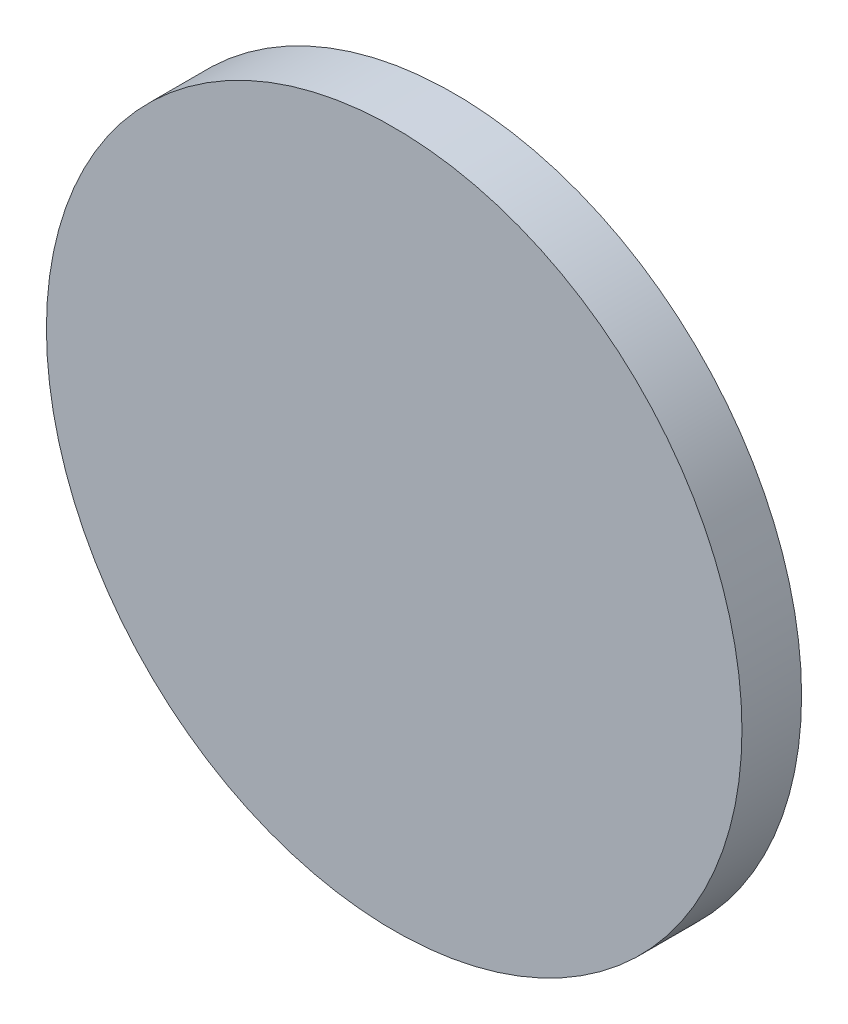
ISO-10303-21;
HEADER;
FILE_DESCRIPTION(('STEP AP214'),'2;1');
FILE_NAME('part.step','',(''),(''),'','','');
FILE_SCHEMA(('AUTOMOTIVE_DESIGN { 1 0 10303 214 1 1 1 1 }'));
ENDSEC;
DATA;
#1=APPLICATION_CONTEXT('core data for automotive mechanical design processes');
#2=APPLICATION_PROTOCOL_DEFINITION('international standard','automotive_design',2000,#1);
#3=PRODUCT_CONTEXT('',#1,'mechanical');
#4=PRODUCT('Part','Part','',(#3));
#5=PRODUCT_RELATED_PRODUCT_CATEGORY('part','',(#4));
#6=PRODUCT_DEFINITION_FORMATION('','',#4);
#7=PRODUCT_DEFINITION_CONTEXT('part definition',#1,'design');
#8=PRODUCT_DEFINITION('design','',#6,#7);
#9=PRODUCT_DEFINITION_SHAPE('','',#8);
#10=(LENGTH_UNIT() NAMED_UNIT(*) SI_UNIT(.MILLI.,.METRE.));
#11=(NAMED_UNIT(*) PLANE_ANGLE_UNIT() SI_UNIT($,.RADIAN.));
#12=(NAMED_UNIT(*) SI_UNIT($,.STERADIAN.) SOLID_ANGLE_UNIT());
#13=UNCERTAINTY_MEASURE_WITH_UNIT(LENGTH_MEASURE(1.E-05),#10,'distance_accuracy_value','');
#14=(GEOMETRIC_REPRESENTATION_CONTEXT(3) GLOBAL_UNCERTAINTY_ASSIGNED_CONTEXT((#13)) GLOBAL_UNIT_ASSIGNED_CONTEXT((#10,
#11,#12)) REPRESENTATION_CONTEXT('',''));
#15=CARTESIAN_POINT('',(0.,0.,0.));
#16=DIRECTION('',(0.,0.,1.));
#17=DIRECTION('',(1.,0.,0.));
#18=AXIS2_PLACEMENT_3D('',#15,#16,#17);
#19=CARTESIAN_POINT('',(5.6007,3.7719,0.79916));
#20=DIRECTION('',(0.,0.,1.));
#21=DIRECTION('',(1.,0.,0.));
#22=AXIS2_PLACEMENT_3D('',#19,#20,#21);
#23=PLANE('',#22);
#24=CARTESIAN_POINT('',(5.6007,3.7719,0.79916));
#25=DIRECTION('',(0.,0.,1.));
#26=DIRECTION('',(1.,0.,0.));
#27=AXIS2_PLACEMENT_3D('',#24,#25,#26);
#28=CIRCLE('',#27,0.200024667);
#29=CARTESIAN_POINT('',(5.800724667,3.7719,0.79916));
#30=VERTEX_POINT('',#29);
#31=EDGE_CURVE('E18',#30,#30,#28,.F.);
#32=ORIENTED_EDGE('',*,*,#31,.F.);
#33=EDGE_LOOP('',(#32));
#34=FACE_BOUND('',#33,.T.);
#35=ADVANCED_FACE('F15',(#34),#23,.T.);
#36=CARTESIAN_POINT('',(5.6007,3.7719,0.76487));
#37=DIRECTION('',(0.,0.,1.));
#38=DIRECTION('',(1.,0.,0.));
#39=AXIS2_PLACEMENT_3D('',#36,#37,#38);
#40=CYLINDRICAL_SURFACE('',#39,0.200024667);
#41=ORIENTED_EDGE('',*,*,#31,.T.);
#42=EDGE_LOOP('',(#41));
#43=FACE_BOUND('',#42,.T.);
#44=CARTESIAN_POINT('',(5.6007,3.7719,0.76487));
#45=DIRECTION('',(0.,0.,1.));
#46=DIRECTION('',(1.,0.,0.));
#47=AXIS2_PLACEMENT_3D('',#44,#45,#46);
#48=CIRCLE('',#47,0.200024667);
#49=CARTESIAN_POINT('',(5.800724667,3.7719,0.76487));
#50=VERTEX_POINT('',#49);
#51=EDGE_CURVE('E10',#50,#50,#48,.F.);
#52=ORIENTED_EDGE('',*,*,#51,.F.);
#53=EDGE_LOOP('',(#52));
#54=FACE_BOUND('',#53,.T.);
#55=ADVANCED_FACE('F27',(#43,#54),#40,.T.);
#56=CARTESIAN_POINT('',(5.6007,3.7719,0.76487));
#57=DIRECTION('',(0.,0.,-1.));
#58=DIRECTION('',(-1.,0.,0.));
#59=AXIS2_PLACEMENT_3D('',#56,#57,#58);
#60=PLANE('',#59);
#61=ORIENTED_EDGE('',*,*,#51,.T.);
#62=EDGE_LOOP('',(#61));
#63=FACE_BOUND('',#62,.T.);
#64=ADVANCED_FACE('F35',(#63),#60,.T.);
#65=CLOSED_SHELL('',(#35,#55,#64));
#66=MANIFOLD_SOLID_BREP('B1',#65);
#67=ADVANCED_BREP_SHAPE_REPRESENTATION('',(#18,#66),#14);
#68=SHAPE_DEFINITION_REPRESENTATION(#9,#67);
ENDSEC;
END-ISO-10303-21;
